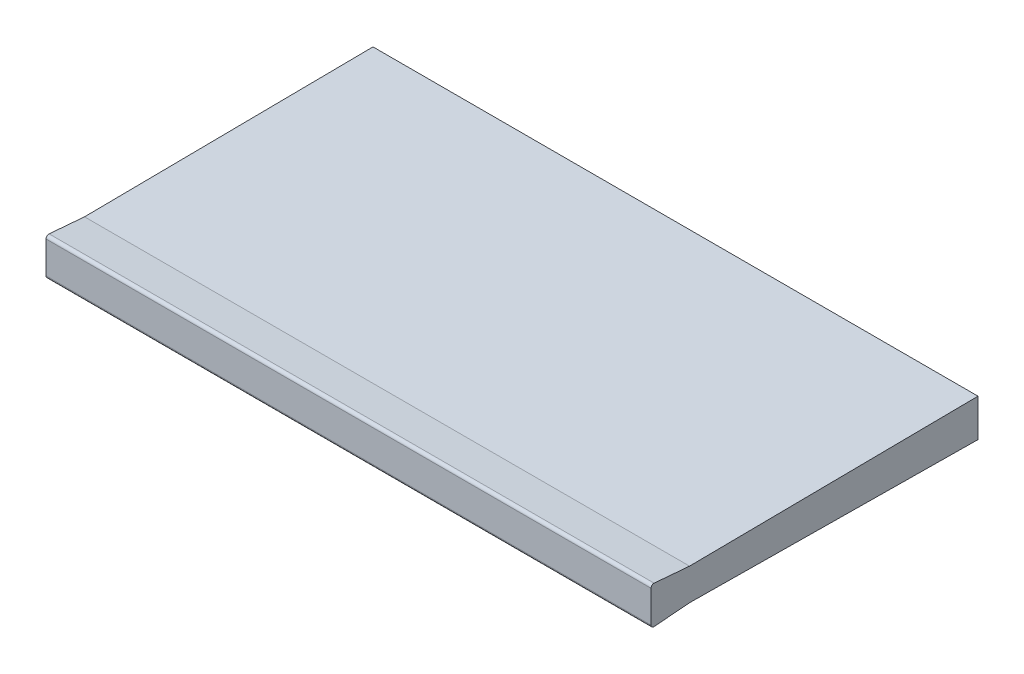
ISO-10303-21;
HEADER;
FILE_DESCRIPTION(('STEP AP214'),'2;1');
FILE_NAME('part.step','',(''),(''),'','','');
FILE_SCHEMA(('AUTOMOTIVE_DESIGN { 1 0 10303 214 1 1 1 1 }'));
ENDSEC;
DATA;
#1=APPLICATION_CONTEXT('core data for automotive mechanical design processes');
#2=APPLICATION_PROTOCOL_DEFINITION('international standard','automotive_design',2000,#1);
#3=PRODUCT_CONTEXT('',#1,'mechanical');
#4=PRODUCT('Part','Part','',(#3));
#5=PRODUCT_RELATED_PRODUCT_CATEGORY('part','',(#4));
#6=PRODUCT_DEFINITION_FORMATION('','',#4);
#7=PRODUCT_DEFINITION_CONTEXT('part definition',#1,'design');
#8=PRODUCT_DEFINITION('design','',#6,#7);
#9=PRODUCT_DEFINITION_SHAPE('','',#8);
#10=(LENGTH_UNIT() NAMED_UNIT(*) SI_UNIT(.MILLI.,.METRE.));
#11=(NAMED_UNIT(*) PLANE_ANGLE_UNIT() SI_UNIT($,.RADIAN.));
#12=(NAMED_UNIT(*) SI_UNIT($,.STERADIAN.) SOLID_ANGLE_UNIT());
#13=UNCERTAINTY_MEASURE_WITH_UNIT(LENGTH_MEASURE(1.E-05),#10,'distance_accuracy_value','');
#14=(GEOMETRIC_REPRESENTATION_CONTEXT(3) GLOBAL_UNCERTAINTY_ASSIGNED_CONTEXT((#13)) GLOBAL_UNIT_ASSIGNED_CONTEXT((#10,
#11,#12)) REPRESENTATION_CONTEXT('',''));
#15=CARTESIAN_POINT('',(0.,0.,0.));
#16=DIRECTION('',(0.,0.,1.));
#17=DIRECTION('',(1.,0.,0.));
#18=AXIS2_PLACEMENT_3D('',#15,#16,#17);
#19=CARTESIAN_POINT('',(21.,6.15660022588363,21.));
#20=DIRECTION('',(-1.,0.,0.));
#21=DIRECTION('',(0.,1.,0.));
#22=AXIS2_PLACEMENT_3D('',#19,#20,#21);
#23=PLANE('',#22);
#24=CARTESIAN_POINT('',(21.,6.15660022588363,21.));
#25=DIRECTION('',(1.,0.,0.));
#26=DIRECTION('',(0.,0.,1.));
#27=AXIS2_PLACEMENT_3D('',#24,#25,#26);
#28=CIRCLE('',#27,0.2);
#29=CARTESIAN_POINT('',(21.,6.35590937753261,20.9833909040292));
#30=VERTEX_POINT('',#29);
#31=CARTESIAN_POINT('',(21.,6.15660022588363,21.2));
#32=VERTEX_POINT('',#31);
#33=EDGE_CURVE('E153',#30,#32,#28,.T.);
#34=ORIENTED_EDGE('',*,*,#33,.T.);
#35=DIRECTION('',(0.,-1.,0.));
#36=VECTOR('',#35,1.);
#37=CARTESIAN_POINT('',(21.,3.94339977411633,21.2));
#38=LINE('',#37,#36);
#39=CARTESIAN_POINT('',(21.,3.94339977411633,21.2));
#40=VERTEX_POINT('',#39);
#41=EDGE_CURVE('E11',#32,#40,#38,.T.);
#42=ORIENTED_EDGE('',*,*,#41,.T.);
#43=CARTESIAN_POINT('',(21.,3.94339977411633,21.));
#44=DIRECTION('',(1.,0.,0.));
#45=DIRECTION('',(0.,0.,1.));
#46=AXIS2_PLACEMENT_3D('',#43,#44,#45);
#47=CIRCLE('',#46,0.2);
#48=CARTESIAN_POINT('',(21.,3.74409062246735,20.9833909040292));
#49=VERTEX_POINT('',#48);
#50=EDGE_CURVE('E168',#40,#49,#47,.T.);
#51=ORIENTED_EDGE('',*,*,#50,.T.);
#52=DIRECTION('',(0.,0.0830454798537399,-0.99654575824488));
#53=VECTOR('',#52,1.);
#54=CARTESIAN_POINT('',(21.,3.94896372747345,18.5249136439561));
#55=LINE('',#54,#53);
#56=CARTESIAN_POINT('',(21.,3.94896372747345,18.5249136439561));
#57=VERTEX_POINT('',#56);
#58=EDGE_CURVE('E161',#49,#57,#55,.T.);
#59=ORIENTED_EDGE('',*,*,#58,.T.);
#60=DIRECTION('',(0.,-0.0102303753863297,-0.999947668340426));
#61=VECTOR('',#60,1.);
#62=CARTESIAN_POINT('',(21.,3.74409062246735,-1.5));
#63=LINE('',#62,#61);
#64=CARTESIAN_POINT('',(21.,3.74409062246735,-1.5));
#65=VERTEX_POINT('',#64);
#66=EDGE_CURVE('E125',#57,#65,#63,.T.);
#67=ORIENTED_EDGE('',*,*,#66,.T.);
#68=DIRECTION('',(0.,1.,0.));
#69=VECTOR('',#68,1.);
#70=CARTESIAN_POINT('',(21.,6.35590937753261,-1.5));
#71=LINE('',#70,#69);
#72=CARTESIAN_POINT('',(21.,6.35590937753261,-1.5));
#73=VERTEX_POINT('',#72);
#74=EDGE_CURVE('E119',#65,#73,#71,.T.);
#75=ORIENTED_EDGE('',*,*,#74,.T.);
#76=DIRECTION('',(0.,-0.0102303753863298,0.999947668340426));
#77=VECTOR('',#76,1.);
#78=CARTESIAN_POINT('',(21.,6.15103627252652,18.5249136439561));
#79=LINE('',#78,#77);
#80=CARTESIAN_POINT('',(21.,6.15103627252652,18.5249136439561));
#81=VERTEX_POINT('',#80);
#82=EDGE_CURVE('E122',#73,#81,#79,.T.);
#83=ORIENTED_EDGE('',*,*,#82,.T.);
#84=DIRECTION('',(0.,0.0830454798537402,0.99654575824488));
#85=VECTOR('',#84,1.);
#86=CARTESIAN_POINT('',(21.,6.35590937753261,20.9833909040292));
#87=LINE('',#86,#85);
#88=EDGE_CURVE('E151',#81,#30,#87,.T.);
#89=ORIENTED_EDGE('',*,*,#88,.T.);
#90=EDGE_LOOP('',(#34,#42,#51,#59,#67,#75,#83,#89));
#91=FACE_BOUND('',#90,.T.);
#92=ADVANCED_FACE('F16',(#91),#23,.F.);
#93=CARTESIAN_POINT('',(-21.,6.15660022588366,21.));
#94=DIRECTION('',(-1.,0.,0.));
#95=DIRECTION('',(0.,1.,0.));
#96=AXIS2_PLACEMENT_3D('',#93,#94,#95);
#97=PLANE('',#96);
#98=DIRECTION('',(0.,1.,0.));
#99=VECTOR('',#98,1.);
#100=CARTESIAN_POINT('',(-21.,3.94339977411635,21.2));
#101=LINE('',#100,#99);
#102=CARTESIAN_POINT('',(-21.,3.94339977411635,21.2));
#103=VERTEX_POINT('',#102);
#104=CARTESIAN_POINT('',(-21.,6.15660022588366,21.2));
#105=VERTEX_POINT('',#104);
#106=EDGE_CURVE('E20',#103,#105,#101,.T.);
#107=ORIENTED_EDGE('',*,*,#106,.T.);
#108=CARTESIAN_POINT('',(-21.,6.15660022588366,21.));
#109=DIRECTION('',(-1.,0.,0.));
#110=DIRECTION('',(0.,0.,1.));
#111=AXIS2_PLACEMENT_3D('',#108,#109,#110);
#112=CIRCLE('',#111,0.2);
#113=CARTESIAN_POINT('',(-21.,6.35590937753264,20.9833909040292));
#114=VERTEX_POINT('',#113);
#115=EDGE_CURVE('E178',#105,#114,#112,.T.);
#116=ORIENTED_EDGE('',*,*,#115,.T.);
#117=DIRECTION('',(0.,-0.0830454798537402,-0.99654575824488));
#118=VECTOR('',#117,1.);
#119=CARTESIAN_POINT('',(-21.,6.35590937753264,20.9833909040292));
#120=LINE('',#119,#118);
#121=CARTESIAN_POINT('',(-21.,6.15103627252654,18.5249136439562));
#122=VERTEX_POINT('',#121);
#123=EDGE_CURVE('E102',#114,#122,#120,.T.);
#124=ORIENTED_EDGE('',*,*,#123,.T.);
#125=DIRECTION('',(0.,0.0102303753863298,-0.999947668340426));
#126=VECTOR('',#125,1.);
#127=CARTESIAN_POINT('',(-21.,6.15103627252654,18.5249136439562));
#128=LINE('',#127,#126);
#129=CARTESIAN_POINT('',(-21.,6.35590937753264,-1.5));
#130=VERTEX_POINT('',#129);
#131=EDGE_CURVE('E142',#122,#130,#128,.T.);
#132=ORIENTED_EDGE('',*,*,#131,.T.);
#133=DIRECTION('',(0.,-1.,0.));
#134=VECTOR('',#133,1.);
#135=CARTESIAN_POINT('',(-21.,6.35590937753264,-1.5));
#136=LINE('',#135,#134);
#137=CARTESIAN_POINT('',(-21.,3.74409062246737,-1.5));
#138=VERTEX_POINT('',#137);
#139=EDGE_CURVE('E129',#130,#138,#136,.T.);
#140=ORIENTED_EDGE('',*,*,#139,.T.);
#141=DIRECTION('',(0.,0.0102303753863297,0.999947668340426));
#142=VECTOR('',#141,1.);
#143=CARTESIAN_POINT('',(-21.,3.74409062246737,-1.5));
#144=LINE('',#143,#142);
#145=CARTESIAN_POINT('',(-21.,3.94896372747347,18.5249136439562));
#146=VERTEX_POINT('',#145);
#147=EDGE_CURVE('E112',#138,#146,#144,.T.);
#148=ORIENTED_EDGE('',*,*,#147,.T.);
#149=DIRECTION('',(0.,-0.0830454798537399,0.99654575824488));
#150=VECTOR('',#149,1.);
#151=CARTESIAN_POINT('',(-21.,3.94896372747347,18.5249136439562));
#152=LINE('',#151,#150);
#153=CARTESIAN_POINT('',(-21.,3.74409062246737,20.9833909040292));
#154=VERTEX_POINT('',#153);
#155=EDGE_CURVE('E157',#146,#154,#152,.T.);
#156=ORIENTED_EDGE('',*,*,#155,.T.);
#157=CARTESIAN_POINT('',(-21.,3.94339977411635,21.));
#158=DIRECTION('',(-1.,0.,0.));
#159=DIRECTION('',(0.,0.,1.));
#160=AXIS2_PLACEMENT_3D('',#157,#158,#159);
#161=CIRCLE('',#160,0.2);
#162=EDGE_CURVE('E174',#154,#103,#161,.T.);
#163=ORIENTED_EDGE('',*,*,#162,.T.);
#164=EDGE_LOOP('',(#107,#116,#124,#132,#140,#148,#156,#163));
#165=FACE_BOUND('',#164,.T.);
#166=ADVANCED_FACE('F213',(#165),#97,.T.);
#167=CARTESIAN_POINT('',(-43.84991940032,3.94339977411637,21.2));
#168=DIRECTION('',(0.,0.,-1.));
#169=DIRECTION('',(0.,-1.,0.));
#170=AXIS2_PLACEMENT_3D('',#167,#168,#169);
#171=PLANE('',#170);
#172=ORIENTED_EDGE('',*,*,#106,.F.);
#173=DIRECTION('',(1.,0.,0.));
#174=VECTOR('',#173,1.);
#175=CARTESIAN_POINT('',(-43.84991940032,3.94339977411637,21.2));
#176=LINE('',#175,#174);
#177=EDGE_CURVE('E165',#103,#40,#176,.T.);
#178=ORIENTED_EDGE('',*,*,#177,.T.);
#179=ORIENTED_EDGE('',*,*,#41,.F.);
#180=DIRECTION('',(1.,0.,0.));
#181=VECTOR('',#180,1.);
#182=CARTESIAN_POINT('',(-43.84991940032,6.15660022588367,21.2));
#183=LINE('',#182,#181);
#184=EDGE_CURVE('E156',#105,#32,#183,.T.);
#185=ORIENTED_EDGE('',*,*,#184,.F.);
#186=EDGE_LOOP('',(#172,#178,#179,#185));
#187=FACE_BOUND('',#186,.T.);
#188=ADVANCED_FACE('F220',(#187),#171,.F.);
#189=CARTESIAN_POINT('',(-43.84991940032,3.94339977411637,21.));
#190=DIRECTION('',(1.,0.,0.));
#191=DIRECTION('',(0.,0.,-1.));
#192=AXIS2_PLACEMENT_3D('',#189,#190,#191);
#193=CYLINDRICAL_SURFACE('',#192,0.2);
#194=ORIENTED_EDGE('',*,*,#162,.F.);
#195=DIRECTION('',(1.,0.,0.));
#196=VECTOR('',#195,1.);
#197=CARTESIAN_POINT('',(-43.84991940032,3.74409062246739,20.9833909040292));
#198=LINE('',#197,#196);
#199=EDGE_CURVE('E171',#154,#49,#198,.T.);
#200=ORIENTED_EDGE('',*,*,#199,.T.);
#201=ORIENTED_EDGE('',*,*,#50,.F.);
#202=ORIENTED_EDGE('',*,*,#177,.F.);
#203=EDGE_LOOP('',(#194,#200,#201,#202));
#204=FACE_BOUND('',#203,.T.);
#205=ADVANCED_FACE('F223',(#204),#193,.T.);
#206=CARTESIAN_POINT('',(-43.84991940032,3.94896372747348,18.5249136439561));
#207=DIRECTION('',(0.,0.99654575824488,0.08304547985374));
#208=DIRECTION('',(1.,0.,0.));
#209=AXIS2_PLACEMENT_3D('',#206,#207,#208);
#210=PLANE('',#209);
#211=ORIENTED_EDGE('',*,*,#155,.F.);
#212=DIRECTION('',(1.,0.,0.));
#213=VECTOR('',#212,1.);
#214=CARTESIAN_POINT('',(-43.84991940032,3.94896372747348,18.5249136439561));
#215=LINE('',#214,#213);
#216=EDGE_CURVE('E162',#146,#57,#215,.T.);
#217=ORIENTED_EDGE('',*,*,#216,.T.);
#218=ORIENTED_EDGE('',*,*,#58,.F.);
#219=ORIENTED_EDGE('',*,*,#199,.F.);
#220=EDGE_LOOP('',(#211,#217,#218,#219));
#221=FACE_BOUND('',#220,.T.);
#222=ADVANCED_FACE('F211',(#221),#210,.F.);
#223=CARTESIAN_POINT('',(-43.84991940032,3.74409062246739,-1.5));
#224=DIRECTION('',(0.,0.999947668340426,-0.0102303753863297));
#225=DIRECTION('',(-1.,0.,0.));
#226=AXIS2_PLACEMENT_3D('',#223,#224,#225);
#227=PLANE('',#226);
#228=ORIENTED_EDGE('',*,*,#147,.F.);
#229=DIRECTION('',(1.,0.,0.));
#230=VECTOR('',#229,1.);
#231=CARTESIAN_POINT('',(-43.84991940032,3.74409062246739,-1.5));
#232=LINE('',#231,#230);
#233=EDGE_CURVE('E128',#138,#65,#232,.T.);
#234=ORIENTED_EDGE('',*,*,#233,.T.);
#235=ORIENTED_EDGE('',*,*,#66,.F.);
#236=ORIENTED_EDGE('',*,*,#216,.F.);
#237=EDGE_LOOP('',(#228,#234,#235,#236));
#238=FACE_BOUND('',#237,.T.);
#239=ADVANCED_FACE('F212',(#238),#227,.F.);
#240=CARTESIAN_POINT('',(-43.84991940032,6.35590937753265,-1.5));
#241=DIRECTION('',(0.,0.,1.));
#242=DIRECTION('',(0.,-1.,0.));
#243=AXIS2_PLACEMENT_3D('',#240,#241,#242);
#244=PLANE('',#243);
#245=ORIENTED_EDGE('',*,*,#139,.F.);
#246=DIRECTION('',(1.,0.,0.));
#247=VECTOR('',#246,1.);
#248=CARTESIAN_POINT('',(-43.84991940032,6.35590937753265,-1.5));
#249=LINE('',#248,#247);
#250=EDGE_CURVE('E132',#130,#73,#249,.T.);
#251=ORIENTED_EDGE('',*,*,#250,.T.);
#252=ORIENTED_EDGE('',*,*,#74,.F.);
#253=ORIENTED_EDGE('',*,*,#233,.F.);
#254=EDGE_LOOP('',(#245,#251,#252,#253));
#255=FACE_BOUND('',#254,.T.);
#256=ADVANCED_FACE('F133',(#255),#244,.F.);
#257=CARTESIAN_POINT('',(-43.84991940032,6.15103627252656,18.5249136439561));
#258=DIRECTION('',(0.,-0.999947668340426,-0.0102303753863298));
#259=DIRECTION('',(1.,0.,0.));
#260=AXIS2_PLACEMENT_3D('',#257,#258,#259);
#261=PLANE('',#260);
#262=ORIENTED_EDGE('',*,*,#131,.F.);
#263=DIRECTION('',(1.,0.,0.));
#264=VECTOR('',#263,1.);
#265=CARTESIAN_POINT('',(-43.84991940032,6.15103627252656,18.5249136439561));
#266=LINE('',#265,#264);
#267=EDGE_CURVE('E139',#122,#81,#266,.T.);
#268=ORIENTED_EDGE('',*,*,#267,.T.);
#269=ORIENTED_EDGE('',*,*,#82,.F.);
#270=ORIENTED_EDGE('',*,*,#250,.F.);
#271=EDGE_LOOP('',(#262,#268,#269,#270));
#272=FACE_BOUND('',#271,.T.);
#273=ADVANCED_FACE('F18',(#272),#261,.F.);
#274=CARTESIAN_POINT('',(-43.84991940032,6.35590937753265,20.9833909040292));
#275=DIRECTION('',(0.,-0.99654575824488,0.0830454798537402));
#276=DIRECTION('',(0.,0.0830454798537403,0.99654575824488));
#277=AXIS2_PLACEMENT_3D('',#274,#275,#276);
#278=PLANE('',#277);
#279=ORIENTED_EDGE('',*,*,#123,.F.);
#280=DIRECTION('',(1.,0.,0.));
#281=VECTOR('',#280,1.);
#282=CARTESIAN_POINT('',(-43.84991940032,6.35590937753265,20.9833909040292));
#283=LINE('',#282,#281);
#284=EDGE_CURVE('E155',#114,#30,#283,.T.);
#285=ORIENTED_EDGE('',*,*,#284,.T.);
#286=ORIENTED_EDGE('',*,*,#88,.F.);
#287=ORIENTED_EDGE('',*,*,#267,.F.);
#288=EDGE_LOOP('',(#279,#285,#286,#287));
#289=FACE_BOUND('',#288,.T.);
#290=ADVANCED_FACE('F214',(#289),#278,.F.);
#291=CARTESIAN_POINT('',(-43.84991940032,6.15660022588367,21.));
#292=DIRECTION('',(1.,0.,0.));
#293=DIRECTION('',(0.,0.,-1.));
#294=AXIS2_PLACEMENT_3D('',#291,#292,#293);
#295=CYLINDRICAL_SURFACE('',#294,0.2);
#296=ORIENTED_EDGE('',*,*,#115,.F.);
#297=ORIENTED_EDGE('',*,*,#184,.T.);
#298=ORIENTED_EDGE('',*,*,#33,.F.);
#299=ORIENTED_EDGE('',*,*,#284,.F.);
#300=EDGE_LOOP('',(#296,#297,#298,#299));
#301=FACE_BOUND('',#300,.T.);
#302=ADVANCED_FACE('F218',(#301),#295,.T.);
#303=CLOSED_SHELL('',(#92,#166,#188,#205,#222,#239,#256,#273,#290,#302));
#304=MANIFOLD_SOLID_BREP('B1',#303);
#305=ADVANCED_BREP_SHAPE_REPRESENTATION('',(#18,#304),#14);
#306=SHAPE_DEFINITION_REPRESENTATION(#9,#305);
ENDSEC;
END-ISO-10303-21;
